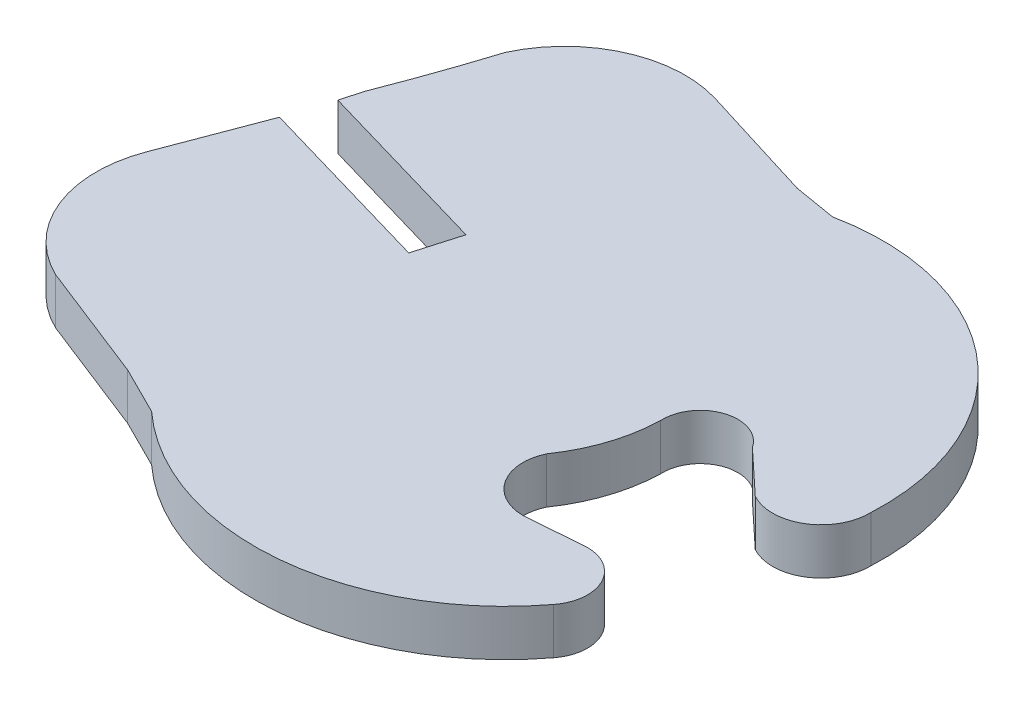
ISO-10303-21;
HEADER;
FILE_DESCRIPTION(('STEP AP214'),'2;1');
FILE_NAME('part.step','',(''),(''),'','','');
FILE_SCHEMA(('AUTOMOTIVE_DESIGN { 1 0 10303 214 1 1 1 1 }'));
ENDSEC;
DATA;
#1=APPLICATION_CONTEXT('core data for automotive mechanical design processes');
#2=APPLICATION_PROTOCOL_DEFINITION('international standard','automotive_design',2000,#1);
#3=PRODUCT_CONTEXT('',#1,'mechanical');
#4=PRODUCT('Part','Part','',(#3));
#5=PRODUCT_RELATED_PRODUCT_CATEGORY('part','',(#4));
#6=PRODUCT_DEFINITION_FORMATION('','',#4);
#7=PRODUCT_DEFINITION_CONTEXT('part definition',#1,'design');
#8=PRODUCT_DEFINITION('design','',#6,#7);
#9=PRODUCT_DEFINITION_SHAPE('','',#8);
#10=(LENGTH_UNIT() NAMED_UNIT(*) SI_UNIT(.MILLI.,.METRE.));
#11=(NAMED_UNIT(*) PLANE_ANGLE_UNIT() SI_UNIT($,.RADIAN.));
#12=(NAMED_UNIT(*) SI_UNIT($,.STERADIAN.) SOLID_ANGLE_UNIT());
#13=UNCERTAINTY_MEASURE_WITH_UNIT(LENGTH_MEASURE(1.E-05),#10,'distance_accuracy_value','');
#14=(GEOMETRIC_REPRESENTATION_CONTEXT(3) GLOBAL_UNCERTAINTY_ASSIGNED_CONTEXT((#13)) GLOBAL_UNIT_ASSIGNED_CONTEXT((#10,
#11,#12)) REPRESENTATION_CONTEXT('',''));
#15=CARTESIAN_POINT('',(0.,0.,0.));
#16=DIRECTION('',(0.,0.,1.));
#17=DIRECTION('',(1.,0.,0.));
#18=AXIS2_PLACEMENT_3D('',#15,#16,#17);
#19=CARTESIAN_POINT('',(-253.536967801551,2.,-735.500523132252));
#20=DIRECTION('',(0.,-1.,0.));
#21=DIRECTION('',(0.,0.,-1.));
#22=AXIS2_PLACEMENT_3D('',#19,#20,#21);
#23=CYLINDRICAL_SURFACE('',#22,71.0818539639846);
#24=CARTESIAN_POINT('',(-253.536967801551,0.,-735.500523132252));
#25=DIRECTION('',(0.,1.,0.));
#26=DIRECTION('',(0.,0.,1.));
#27=AXIS2_PLACEMENT_3D('',#24,#25,#26);
#28=CIRCLE('',#27,71.0818539639846);
#29=CARTESIAN_POINT('',(-187.311900000046,0.,-709.676689999982));
#30=VERTEX_POINT('',#29);
#31=CARTESIAN_POINT('',(-185.723570000009,0.,-714.193879999953));
#32=VERTEX_POINT('',#31);
#33=EDGE_CURVE('E11',#30,#32,#28,.T.);
#34=ORIENTED_EDGE('',*,*,#33,.F.);
#35=DIRECTION('',(0.,-1.,0.));
#36=VECTOR('',#35,1.);
#37=CARTESIAN_POINT('',(-187.311900000046,2.,-709.676689999982));
#38=LINE('',#37,#36);
#39=CARTESIAN_POINT('',(-187.311900000046,2.,-709.676689999982));
#40=VERTEX_POINT('',#39);
#41=EDGE_CURVE('E56',#40,#30,#38,.T.);
#42=ORIENTED_EDGE('',*,*,#41,.F.);
#43=CARTESIAN_POINT('',(-253.536967801551,2.,-735.500523132252));
#44=DIRECTION('',(0.,1.,0.));
#45=DIRECTION('',(0.,0.,1.));
#46=AXIS2_PLACEMENT_3D('',#43,#44,#45);
#47=CIRCLE('',#46,71.0818539639846);
#48=CARTESIAN_POINT('',(-185.723570000009,2.,-714.193879999953));
#49=VERTEX_POINT('',#48);
#50=EDGE_CURVE('E41',#40,#49,#47,.T.);
#51=ORIENTED_EDGE('',*,*,#50,.T.);
#52=DIRECTION('',(0.,-1.,0.));
#53=VECTOR('',#52,1.);
#54=CARTESIAN_POINT('',(-185.723570000009,2.,-714.193879999953));
#55=LINE('',#54,#53);
#56=EDGE_CURVE('E132',#49,#32,#55,.T.);
#57=ORIENTED_EDGE('',*,*,#56,.T.);
#58=EDGE_LOOP('',(#34,#42,#51,#57));
#59=FACE_BOUND('',#58,.T.);
#60=ADVANCED_FACE('F37',(#59),#23,.F.);
#61=CARTESIAN_POINT('',(-246.404862133182,2.,-495.16026197357));
#62=DIRECTION('',(0.964089313143234,0.,0.265578230062267));
#63=DIRECTION('',(0.265578230062267,0.,-0.964089313143234));
#64=AXIS2_PLACEMENT_3D('',#61,#62,#63);
#65=PLANE('',#64);
#66=DIRECTION('',(-0.265578230062267,0.,0.964089313143234));
#67=VECTOR('',#66,1.);
#68=CARTESIAN_POINT('',(-246.404862133182,0.,-495.16026197357));
#69=LINE('',#68,#67);
#70=CARTESIAN_POINT('',(-187.560110000046,0.,-708.775649999982));
#71=VERTEX_POINT('',#70);
#72=EDGE_CURVE('E47',#30,#71,#69,.T.);
#73=ORIENTED_EDGE('',*,*,#72,.T.);
#74=DIRECTION('',(0.,-1.,0.));
#75=VECTOR('',#74,1.);
#76=CARTESIAN_POINT('',(-187.560110000046,2.,-708.775649999982));
#77=LINE('',#76,#75);
#78=CARTESIAN_POINT('',(-187.560110000046,2.,-708.775649999982));
#79=VERTEX_POINT('',#78);
#80=EDGE_CURVE('E195',#79,#71,#77,.T.);
#81=ORIENTED_EDGE('',*,*,#80,.F.);
#82=DIRECTION('',(-0.265578230062267,0.,0.964089313143234));
#83=VECTOR('',#82,1.);
#84=CARTESIAN_POINT('',(-246.404862133182,2.,-495.16026197357));
#85=LINE('',#84,#83);
#86=EDGE_CURVE('E122',#40,#79,#85,.T.);
#87=ORIENTED_EDGE('',*,*,#86,.F.);
#88=ORIENTED_EDGE('',*,*,#41,.T.);
#89=EDGE_LOOP('',(#73,#81,#87,#88));
#90=FACE_BOUND('',#89,.T.);
#91=ADVANCED_FACE('F364',(#90),#65,.F.);
#92=CARTESIAN_POINT('',(-462.908831557613,2.,-788.794902365143));
#93=DIRECTION('',(0.279065246758814,0.,-0.960272142703016));
#94=DIRECTION('',(-0.960272142703016,0.,-0.279065246758814));
#95=AXIS2_PLACEMENT_3D('',#92,#93,#94);
#96=PLANE('',#95);
#97=DIRECTION('',(0.960272142703016,0.,0.279065246758815));
#98=VECTOR('',#97,1.);
#99=CARTESIAN_POINT('',(-462.908831557613,0.,-788.794902365143));
#100=LINE('',#99,#98);
#101=CARTESIAN_POINT('',(-179.737580000009,0.,-706.502339999971));
#102=VERTEX_POINT('',#101);
#103=EDGE_CURVE('E189',#71,#102,#100,.T.);
#104=ORIENTED_EDGE('',*,*,#103,.T.);
#105=DIRECTION('',(0.,-1.,0.));
#106=VECTOR('',#105,1.);
#107=CARTESIAN_POINT('',(-179.737580000009,2.,-706.502339999971));
#108=LINE('',#107,#106);
#109=CARTESIAN_POINT('',(-179.737580000009,2.,-706.502339999971));
#110=VERTEX_POINT('',#109);
#111=EDGE_CURVE('E193',#110,#102,#108,.T.);
#112=ORIENTED_EDGE('',*,*,#111,.F.);
#113=DIRECTION('',(0.960272142703016,0.,0.279065246758815));
#114=VECTOR('',#113,1.);
#115=CARTESIAN_POINT('',(-462.908831557613,2.,-788.794902365143));
#116=LINE('',#115,#114);
#117=EDGE_CURVE('E254',#79,#110,#116,.T.);
#118=ORIENTED_EDGE('',*,*,#117,.F.);
#119=ORIENTED_EDGE('',*,*,#80,.T.);
#120=EDGE_LOOP('',(#104,#112,#118,#119));
#121=FACE_BOUND('',#120,.T.);
#122=ADVANCED_FACE('F191',(#121),#96,.F.);
#123=CARTESIAN_POINT('',(-242.699576697375,2.,-489.851208102719));
#124=DIRECTION('',(0.960271091452544,0.,0.279068864118768));
#125=DIRECTION('',(0.279068864118768,0.,-0.960271091452544));
#126=AXIS2_PLACEMENT_3D('',#123,#124,#125);
#127=PLANE('',#126);
#128=DIRECTION('',(-0.279068864118768,0.,0.960271091452544));
#129=VECTOR('',#128,1.);
#130=CARTESIAN_POINT('',(-242.699576697375,0.,-489.851208102719));
#131=LINE('',#130,#129);
#132=CARTESIAN_POINT('',(-180.29572,0.,-704.58179));
#133=VERTEX_POINT('',#132);
#134=EDGE_CURVE('E198',#102,#133,#131,.T.);
#135=ORIENTED_EDGE('',*,*,#134,.T.);
#136=DIRECTION('',(0.,-1.,0.));
#137=VECTOR('',#136,1.);
#138=CARTESIAN_POINT('',(-180.29572,2.,-704.58179));
#139=LINE('',#138,#137);
#140=CARTESIAN_POINT('',(-180.29572,2.,-704.58179));
#141=VERTEX_POINT('',#140);
#142=EDGE_CURVE('E205',#141,#133,#139,.T.);
#143=ORIENTED_EDGE('',*,*,#142,.F.);
#144=DIRECTION('',(-0.279068864118768,0.,0.960271091452544));
#145=VECTOR('',#144,1.);
#146=CARTESIAN_POINT('',(-242.699576697375,2.,-489.851208102719));
#147=LINE('',#146,#145);
#148=EDGE_CURVE('E204',#110,#141,#147,.T.);
#149=ORIENTED_EDGE('',*,*,#148,.F.);
#150=ORIENTED_EDGE('',*,*,#111,.T.);
#151=EDGE_LOOP('',(#135,#143,#149,#150));
#152=FACE_BOUND('',#151,.T.);
#153=ADVANCED_FACE('F201',(#152),#127,.F.);
#154=CARTESIAN_POINT('',(-463.466398165116,2.,-786.874771070459));
#155=DIRECTION('',(-0.279067077141788,0.,0.960271610772462));
#156=DIRECTION('',(0.960271610772462,0.,0.279067077141788));
#157=AXIS2_PLACEMENT_3D('',#154,#155,#156);
#158=PLANE('',#157);
#159=DIRECTION('',(-0.960271610772462,0.,-0.279067077141788));
#160=VECTOR('',#159,1.);
#161=CARTESIAN_POINT('',(-463.466398165116,0.,-786.874771070459));
#162=LINE('',#161,#160);
#163=CARTESIAN_POINT('',(-188.18261,0.,-706.87382));
#164=VERTEX_POINT('',#163);
#165=EDGE_CURVE('E210',#133,#164,#162,.T.);
#166=ORIENTED_EDGE('',*,*,#165,.T.);
#167=DIRECTION('',(0.,-1.,0.));
#168=VECTOR('',#167,1.);
#169=CARTESIAN_POINT('',(-188.18261,2.,-706.87382));
#170=LINE('',#169,#168);
#171=CARTESIAN_POINT('',(-188.18261,2.,-706.87382));
#172=VERTEX_POINT('',#171);
#173=EDGE_CURVE('E303',#172,#164,#170,.T.);
#174=ORIENTED_EDGE('',*,*,#173,.F.);
#175=DIRECTION('',(-0.960271610772462,0.,-0.279067077141788));
#176=VECTOR('',#175,1.);
#177=CARTESIAN_POINT('',(-463.466398165116,2.,-786.874771070459));
#178=LINE('',#177,#176);
#179=EDGE_CURVE('E251',#141,#172,#178,.T.);
#180=ORIENTED_EDGE('',*,*,#179,.F.);
#181=ORIENTED_EDGE('',*,*,#142,.T.);
#182=EDGE_LOOP('',(#166,#174,#180,#181));
#183=FACE_BOUND('',#182,.T.);
#184=ADVANCED_FACE('F375',(#183),#158,.F.);
#185=CARTESIAN_POINT('',(-275.057840685648,2.,-477.252225552402));
#186=DIRECTION('',(0.935297872812625,0.,0.353861398166258));
#187=DIRECTION('',(0.353861398166258,0.,-0.935297872812625));
#188=AXIS2_PLACEMENT_3D('',#185,#186,#187);
#189=PLANE('',#188);
#190=DIRECTION('',(-0.353861398166258,0.,0.935297872812625));
#191=VECTOR('',#190,1.);
#192=CARTESIAN_POINT('',(-275.057840685648,0.,-477.252225552402));
#193=LINE('',#192,#191);
#194=CARTESIAN_POINT('',(-189.75504,0.,-702.7177));
#195=VERTEX_POINT('',#194);
#196=EDGE_CURVE('E212',#164,#195,#193,.T.);
#197=ORIENTED_EDGE('',*,*,#196,.T.);
#198=DIRECTION('',(0.,-1.,0.));
#199=VECTOR('',#198,1.);
#200=CARTESIAN_POINT('',(-189.75504,2.,-702.7177));
#201=LINE('',#200,#199);
#202=CARTESIAN_POINT('',(-189.75504,2.,-702.7177));
#203=VERTEX_POINT('',#202);
#204=EDGE_CURVE('E300',#203,#195,#201,.T.);
#205=ORIENTED_EDGE('',*,*,#204,.F.);
#206=DIRECTION('',(-0.353861398166258,0.,0.935297872812625));
#207=VECTOR('',#206,1.);
#208=CARTESIAN_POINT('',(-275.057840685648,2.,-477.252225552402));
#209=LINE('',#208,#207);
#210=EDGE_CURVE('E249',#172,#203,#209,.T.);
#211=ORIENTED_EDGE('',*,*,#210,.F.);
#212=ORIENTED_EDGE('',*,*,#173,.T.);
#213=EDGE_LOOP('',(#197,#205,#211,#212));
#214=FACE_BOUND('',#213,.T.);
#215=ADVANCED_FACE('F298',(#214),#189,.F.);
#216=CARTESIAN_POINT('',(-184.856848774086,2.,-700.849436922793));
#217=DIRECTION('',(0.,-1.,0.));
#218=DIRECTION('',(0.,0.,-1.));
#219=AXIS2_PLACEMENT_3D('',#216,#217,#218);
#220=CYLINDRICAL_SURFACE('',#219,5.2423929852);
#221=CARTESIAN_POINT('',(-184.856848774086,0.,-700.849436922793));
#222=DIRECTION('',(0.,1.,0.));
#223=DIRECTION('',(0.,0.,1.));
#224=AXIS2_PLACEMENT_3D('',#221,#222,#223);
#225=CIRCLE('',#224,5.2423929852);
#226=CARTESIAN_POINT('',(-187.128520000016,0.,-696.124799999965));
#227=VERTEX_POINT('',#226);
#228=EDGE_CURVE('E293',#195,#227,#225,.T.);
#229=ORIENTED_EDGE('',*,*,#228,.T.);
#230=DIRECTION('',(0.,-1.,0.));
#231=VECTOR('',#230,1.);
#232=CARTESIAN_POINT('',(-187.128520000016,2.,-696.124799999965));
#233=LINE('',#232,#231);
#234=CARTESIAN_POINT('',(-187.128520000016,2.,-696.124799999965));
#235=VERTEX_POINT('',#234);
#236=EDGE_CURVE('E309',#235,#227,#233,.T.);
#237=ORIENTED_EDGE('',*,*,#236,.F.);
#238=CARTESIAN_POINT('',(-184.856848774086,2.,-700.849436922793));
#239=DIRECTION('',(0.,1.,0.));
#240=DIRECTION('',(0.,0.,1.));
#241=AXIS2_PLACEMENT_3D('',#238,#239,#240);
#242=CIRCLE('',#241,5.2423929852);
#243=EDGE_CURVE('E247',#203,#235,#242,.T.);
#244=ORIENTED_EDGE('',*,*,#243,.F.);
#245=ORIENTED_EDGE('',*,*,#204,.T.);
#246=EDGE_LOOP('',(#229,#237,#244,#245));
#247=FACE_BOUND('',#246,.T.);
#248=ADVANCED_FACE('F306',(#247),#220,.T.);
#249=CARTESIAN_POINT('',(-438.470963875038,2.,-794.788940411859));
#250=DIRECTION('',(0.36540360369791,0.,-0.930849185638888));
#251=DIRECTION('',(-0.930849185638888,0.,-0.36540360369791));
#252=AXIS2_PLACEMENT_3D('',#249,#250,#251);
#253=PLANE('',#252);
#254=DIRECTION('',(0.930849185638888,0.,0.36540360369791));
#255=VECTOR('',#254,1.);
#256=CARTESIAN_POINT('',(-438.470963875038,0.,-794.788940411859));
#257=LINE('',#256,#255);
#258=CARTESIAN_POINT('',(-181.99736,0.,-694.11057));
#259=VERTEX_POINT('',#258);
#260=EDGE_CURVE('E291',#227,#259,#257,.T.);
#261=ORIENTED_EDGE('',*,*,#260,.T.);
#262=DIRECTION('',(0.,-1.,0.));
#263=VECTOR('',#262,1.);
#264=CARTESIAN_POINT('',(-181.99736,2.,-694.11057));
#265=LINE('',#264,#263);
#266=CARTESIAN_POINT('',(-181.99736,2.,-694.11057));
#267=VERTEX_POINT('',#266);
#268=EDGE_CURVE('E319',#267,#259,#265,.T.);
#269=ORIENTED_EDGE('',*,*,#268,.F.);
#270=DIRECTION('',(0.930849185638888,0.,0.36540360369791));
#271=VECTOR('',#270,1.);
#272=CARTESIAN_POINT('',(-438.470963875038,2.,-794.788940411859));
#273=LINE('',#272,#271);
#274=EDGE_CURVE('E245',#235,#267,#273,.T.);
#275=ORIENTED_EDGE('',*,*,#274,.F.);
#276=ORIENTED_EDGE('',*,*,#236,.T.);
#277=EDGE_LOOP('',(#261,#269,#275,#276));
#278=FACE_BOUND('',#277,.T.);
#279=ADVANCED_FACE('F317',(#278),#253,.F.);
#280=CARTESIAN_POINT('',(-408.354469762057,2.,-807.252060048962));
#281=DIRECTION('',(0.447096417645095,0.,-0.894485770333393));
#282=DIRECTION('',(-0.894485770333393,0.,-0.447096417645095));
#283=AXIS2_PLACEMENT_3D('',#280,#281,#282);
#284=PLANE('',#283);
#285=DIRECTION('',(0.894485770333393,0.,0.447096417645095));
#286=VECTOR('',#285,1.);
#287=CARTESIAN_POINT('',(-408.354469762057,0.,-807.252060048962));
#288=LINE('',#287,#286);
#289=CARTESIAN_POINT('',(-179.92096,0.,-693.07271));
#290=VERTEX_POINT('',#289);
#291=EDGE_CURVE('E289',#259,#290,#288,.T.);
#292=ORIENTED_EDGE('',*,*,#291,.T.);
#293=DIRECTION('',(0.,-1.,0.));
#294=VECTOR('',#293,1.);
#295=CARTESIAN_POINT('',(-179.92096,2.,-693.07271));
#296=LINE('',#295,#294);
#297=CARTESIAN_POINT('',(-179.92096,2.,-693.07271));
#298=VERTEX_POINT('',#297);
#299=EDGE_CURVE('E325',#298,#290,#296,.T.);
#300=ORIENTED_EDGE('',*,*,#299,.F.);
#301=DIRECTION('',(0.894485770333393,0.,0.447096417645095));
#302=VECTOR('',#301,1.);
#303=CARTESIAN_POINT('',(-408.354469762057,2.,-807.252060048962));
#304=LINE('',#303,#302);
#305=EDGE_CURVE('E243',#267,#298,#304,.T.);
#306=ORIENTED_EDGE('',*,*,#305,.F.);
#307=ORIENTED_EDGE('',*,*,#268,.T.);
#308=EDGE_LOOP('',(#292,#300,#306,#307));
#309=FACE_BOUND('',#308,.T.);
#310=ADVANCED_FACE('F322',(#309),#284,.F.);
#311=CARTESIAN_POINT('',(-172.617160878917,2.,-701.071479919178));
#312=DIRECTION('',(0.,-1.,0.));
#313=DIRECTION('',(0.,0.,-1.));
#314=AXIS2_PLACEMENT_3D('',#311,#312,#313);
#315=CYLINDRICAL_SURFACE('',#314,10.8317035512);
#316=CARTESIAN_POINT('',(-172.617160878917,0.,-701.071479919178));
#317=DIRECTION('',(0.,1.,0.));
#318=DIRECTION('',(0.,0.,1.));
#319=AXIS2_PLACEMENT_3D('',#316,#317,#318);
#320=CIRCLE('',#319,10.8317035512);
#321=CARTESIAN_POINT('',(-163.977899999968,0.,-694.537799999978));
#322=VERTEX_POINT('',#321);
#323=EDGE_CURVE('E287',#290,#322,#320,.T.);
#324=ORIENTED_EDGE('',*,*,#323,.T.);
#325=DIRECTION('',(0.,-1.,0.));
#326=VECTOR('',#325,1.);
#327=CARTESIAN_POINT('',(-163.977899999968,2.,-694.537799999978));
#328=LINE('',#327,#326);
#329=CARTESIAN_POINT('',(-163.977899999968,2.,-694.537799999978));
#330=VERTEX_POINT('',#329);
#331=EDGE_CURVE('E327',#330,#322,#328,.T.);
#332=ORIENTED_EDGE('',*,*,#331,.F.);
#333=CARTESIAN_POINT('',(-172.617160878917,2.,-701.071479919178));
#334=DIRECTION('',(0.,1.,0.));
#335=DIRECTION('',(0.,0.,1.));
#336=AXIS2_PLACEMENT_3D('',#333,#334,#335);
#337=CIRCLE('',#336,10.8317035512);
#338=EDGE_CURVE('E241',#298,#330,#337,.T.);
#339=ORIENTED_EDGE('',*,*,#338,.F.);
#340=ORIENTED_EDGE('',*,*,#299,.T.);
#341=EDGE_LOOP('',(#324,#332,#339,#340));
#342=FACE_BOUND('',#341,.T.);
#343=ADVANCED_FACE('F387',(#342),#315,.T.);
#344=CARTESIAN_POINT('',(-165.377629532629,2.,-695.6308790457));
#345=DIRECTION('',(0.,-1.,0.));
#346=DIRECTION('',(0.,0.,-1.));
#347=AXIS2_PLACEMENT_3D('',#344,#345,#346);
#348=CYLINDRICAL_SURFACE('',#347,1.77596862719998);
#349=CARTESIAN_POINT('',(-165.377629532629,0.,-695.6308790457));
#350=DIRECTION('',(0.,1.,0.));
#351=DIRECTION('',(0.,0.,1.));
#352=AXIS2_PLACEMENT_3D('',#349,#350,#351);
#353=CIRCLE('',#352,1.77596862719998);
#354=CARTESIAN_POINT('',(-165.382850000039,0.,-697.40684000009));
#355=VERTEX_POINT('',#354);
#356=EDGE_CURVE('E285',#322,#355,#353,.T.);
#357=ORIENTED_EDGE('',*,*,#356,.T.);
#358=DIRECTION('',(0.,-1.,0.));
#359=VECTOR('',#358,1.);
#360=CARTESIAN_POINT('',(-165.382850000039,2.,-697.40684000009));
#361=LINE('',#360,#359);
#362=CARTESIAN_POINT('',(-165.382850000039,2.,-697.40684000009));
#363=VERTEX_POINT('',#362);
#364=EDGE_CURVE('E333',#363,#355,#361,.T.);
#365=ORIENTED_EDGE('',*,*,#364,.F.);
#366=CARTESIAN_POINT('',(-165.377629532629,2.,-695.6308790457));
#367=DIRECTION('',(0.,1.,0.));
#368=DIRECTION('',(0.,0.,1.));
#369=AXIS2_PLACEMENT_3D('',#366,#367,#368);
#370=CIRCLE('',#369,1.77596862719998);
#371=EDGE_CURVE('E239',#330,#363,#370,.T.);
#372=ORIENTED_EDGE('',*,*,#371,.F.);
#373=ORIENTED_EDGE('',*,*,#331,.T.);
#374=EDGE_LOOP('',(#357,#365,#372,#373));
#375=FACE_BOUND('',#374,.T.);
#376=ADVANCED_FACE('F390',(#375),#348,.T.);
#377=CARTESIAN_POINT('',(-533.322445939473,2.,-669.134090830796));
#378=DIRECTION('',(0.0766148821574353,0.,0.997060760351145));
#379=DIRECTION('',(0.997060760351145,0.,-0.0766148821574353));
#380=AXIS2_PLACEMENT_3D('',#377,#378,#379);
#381=PLANE('',#380);
#382=DIRECTION('',(-0.997060760351144,0.,0.0766148821574353));
#383=VECTOR('',#382,1.);
#384=CARTESIAN_POINT('',(-533.322445939473,0.,-669.134090830796));
#385=LINE('',#384,#383);
#386=CARTESIAN_POINT('',(-167.76505,0.,-697.22379));
#387=VERTEX_POINT('',#386);
#388=EDGE_CURVE('E282',#355,#387,#385,.T.);
#389=ORIENTED_EDGE('',*,*,#388,.T.);
#390=DIRECTION('',(0.,-1.,0.));
#391=VECTOR('',#390,1.);
#392=CARTESIAN_POINT('',(-167.76505,2.,-697.22379));
#393=LINE('',#392,#391);
#394=CARTESIAN_POINT('',(-167.76505,2.,-697.22379));
#395=VERTEX_POINT('',#394);
#396=EDGE_CURVE('E336',#395,#387,#393,.T.);
#397=ORIENTED_EDGE('',*,*,#396,.F.);
#398=DIRECTION('',(-0.997060760351144,0.,0.0766148821574353));
#399=VECTOR('',#398,1.);
#400=CARTESIAN_POINT('',(-533.322445939473,2.,-669.134090830796));
#401=LINE('',#400,#399);
#402=EDGE_CURVE('E237',#363,#395,#401,.T.);
#403=ORIENTED_EDGE('',*,*,#402,.F.);
#404=ORIENTED_EDGE('',*,*,#364,.T.);
#405=EDGE_LOOP('',(#389,#397,#403,#404));
#406=FACE_BOUND('',#405,.T.);
#407=ADVANCED_FACE('F394',(#406),#381,.F.);
#408=CARTESIAN_POINT('',(-167.982611307997,2.,-699.194911822273));
#409=DIRECTION('',(0.,-1.,0.));
#410=DIRECTION('',(0.,0.,-1.));
#411=AXIS2_PLACEMENT_3D('',#408,#409,#410);
#412=CYLINDRICAL_SURFACE('',#411,1.98309207072681);
#413=CARTESIAN_POINT('',(-167.982611307997,0.,-699.194911822273));
#414=DIRECTION('',(0.,1.,0.));
#415=DIRECTION('',(0.,0.,1.));
#416=AXIS2_PLACEMENT_3D('',#413,#414,#415);
#417=CIRCLE('',#416,1.98309207072681);
#418=CARTESIAN_POINT('',(-169.780509999981,0.,-700.031699999976));
#419=VERTEX_POINT('',#418);
#420=EDGE_CURVE('E279',#419,#387,#417,.T.);
#421=ORIENTED_EDGE('',*,*,#420,.F.);
#422=DIRECTION('',(0.,-1.,0.));
#423=VECTOR('',#422,1.);
#424=CARTESIAN_POINT('',(-169.780509999981,2.,-700.031699999976));
#425=LINE('',#424,#423);
#426=CARTESIAN_POINT('',(-169.780509999981,2.,-700.031699999976));
#427=VERTEX_POINT('',#426);
#428=EDGE_CURVE('E338',#427,#419,#425,.T.);
#429=ORIENTED_EDGE('',*,*,#428,.F.);
#430=CARTESIAN_POINT('',(-167.982611307997,2.,-699.194911822273));
#431=DIRECTION('',(0.,1.,0.));
#432=DIRECTION('',(0.,0.,1.));
#433=AXIS2_PLACEMENT_3D('',#430,#431,#432);
#434=CIRCLE('',#433,1.98309207072681);
#435=EDGE_CURVE('E234',#427,#395,#434,.T.);
#436=ORIENTED_EDGE('',*,*,#435,.T.);
#437=ORIENTED_EDGE('',*,*,#396,.T.);
#438=EDGE_LOOP('',(#421,#429,#436,#437));
#439=FACE_BOUND('',#438,.T.);
#440=ADVANCED_FACE('F398',(#439),#412,.F.);
#441=CARTESIAN_POINT('',(-175.386632426423,2.,-703.933032604025));
#442=DIRECTION('',(0.,-1.,0.));
#443=DIRECTION('',(0.,0.,-1.));
#444=AXIS2_PLACEMENT_3D('',#441,#442,#443);
#445=CYLINDRICAL_SURFACE('',#444,6.83000766820003);
#446=CARTESIAN_POINT('',(-175.386632426423,0.,-703.933032604025));
#447=DIRECTION('',(0.,1.,0.));
#448=DIRECTION('',(0.,0.,1.));
#449=AXIS2_PLACEMENT_3D('',#446,#447,#448);
#450=CIRCLE('',#449,6.83000766820003);
#451=CARTESIAN_POINT('',(-168.55894000005,0.,-703.755209999941));
#452=VERTEX_POINT('',#451);
#453=EDGE_CURVE('E276',#419,#452,#450,.T.);
#454=ORIENTED_EDGE('',*,*,#453,.T.);
#455=DIRECTION('',(0.,-1.,0.));
#456=VECTOR('',#455,1.);
#457=CARTESIAN_POINT('',(-168.55894000005,2.,-703.755209999941));
#458=LINE('',#457,#456);
#459=CARTESIAN_POINT('',(-168.55894000005,2.,-703.755209999941));
#460=VERTEX_POINT('',#459);
#461=EDGE_CURVE('E340',#460,#452,#458,.T.);
#462=ORIENTED_EDGE('',*,*,#461,.F.);
#463=CARTESIAN_POINT('',(-175.386632426423,2.,-703.933032604025));
#464=DIRECTION('',(0.,1.,0.));
#465=DIRECTION('',(0.,0.,1.));
#466=AXIS2_PLACEMENT_3D('',#463,#464,#465);
#467=CIRCLE('',#466,6.83000766820003);
#468=EDGE_CURVE('E232',#427,#460,#467,.T.);
#469=ORIENTED_EDGE('',*,*,#468,.F.);
#470=ORIENTED_EDGE('',*,*,#428,.T.);
#471=EDGE_LOOP('',(#454,#462,#469,#470));
#472=FACE_BOUND('',#471,.T.);
#473=ADVANCED_FACE('F402',(#472),#445,.T.);
#474=CARTESIAN_POINT('',(-166.930930943495,2.,-703.840199692086));
#475=DIRECTION('',(0.,-1.,0.));
#476=DIRECTION('',(0.,0.,-1.));
#477=AXIS2_PLACEMENT_3D('',#474,#475,#476);
#478=CYLINDRICAL_SURFACE('',#477,1.6302259769732);
#479=CARTESIAN_POINT('',(-166.930930943495,0.,-703.840199692086));
#480=DIRECTION('',(0.,1.,0.));
#481=DIRECTION('',(0.,0.,1.));
#482=AXIS2_PLACEMENT_3D('',#479,#480,#481);
#483=CIRCLE('',#482,1.6302259769732);
#484=CARTESIAN_POINT('',(-165.566220000025,0.,-704.731940000009));
#485=VERTEX_POINT('',#484);
#486=EDGE_CURVE('E273',#485,#452,#483,.T.);
#487=ORIENTED_EDGE('',*,*,#486,.F.);
#488=DIRECTION('',(0.,-1.,0.));
#489=VECTOR('',#488,1.);
#490=CARTESIAN_POINT('',(-165.566220000025,2.,-704.731940000009));
#491=LINE('',#490,#489);
#492=CARTESIAN_POINT('',(-165.566220000025,2.,-704.731940000009));
#493=VERTEX_POINT('',#492);
#494=EDGE_CURVE('E342',#493,#485,#491,.T.);
#495=ORIENTED_EDGE('',*,*,#494,.F.);
#496=CARTESIAN_POINT('',(-166.930930943495,2.,-703.840199692086));
#497=DIRECTION('',(0.,1.,0.));
#498=DIRECTION('',(0.,0.,1.));
#499=AXIS2_PLACEMENT_3D('',#496,#497,#498);
#500=CIRCLE('',#499,1.6302259769732);
#501=EDGE_CURVE('E229',#493,#460,#500,.T.);
#502=ORIENTED_EDGE('',*,*,#501,.T.);
#503=ORIENTED_EDGE('',*,*,#461,.T.);
#504=EDGE_LOOP('',(#487,#495,#502,#503));
#505=FACE_BOUND('',#504,.T.);
#506=ADVANCED_FACE('F406',(#505),#478,.F.);
#507=CARTESIAN_POINT('',(-291.762085973035,2.,-822.661677941913));
#508=DIRECTION('',(0.682772753415186,0.,-0.730630800879518));
#509=DIRECTION('',(-0.730630800879518,0.,-0.682772753415186));
#510=AXIS2_PLACEMENT_3D('',#507,#508,#509);
#511=PLANE('',#510);
#512=DIRECTION('',(0.730630800879518,0.,0.682772753415186));
#513=VECTOR('',#512,1.);
#514=CARTESIAN_POINT('',(-291.762085973035,0.,-822.661677941913));
#515=LINE('',#514,#513);
#516=CARTESIAN_POINT('',(-163.672090000017,0.,-702.961879999971));
#517=VERTEX_POINT('',#516);
#518=EDGE_CURVE('E271',#485,#517,#515,.T.);
#519=ORIENTED_EDGE('',*,*,#518,.T.);
#520=DIRECTION('',(0.,-1.,0.));
#521=VECTOR('',#520,1.);
#522=CARTESIAN_POINT('',(-163.672090000017,2.,-702.961879999971));
#523=LINE('',#522,#521);
#524=CARTESIAN_POINT('',(-163.672090000017,2.,-702.961879999971));
#525=VERTEX_POINT('',#524);
#526=EDGE_CURVE('E344',#525,#517,#523,.T.);
#527=ORIENTED_EDGE('',*,*,#526,.F.);
#528=DIRECTION('',(0.730630800879518,0.,0.682772753415186));
#529=VECTOR('',#528,1.);
#530=CARTESIAN_POINT('',(-291.762085973035,2.,-822.661677941913));
#531=LINE('',#530,#529);
#532=EDGE_CURVE('E227',#493,#525,#531,.T.);
#533=ORIENTED_EDGE('',*,*,#532,.F.);
#534=ORIENTED_EDGE('',*,*,#494,.T.);
#535=EDGE_LOOP('',(#519,#527,#533,#534));
#536=FACE_BOUND('',#535,.T.);
#537=ADVANCED_FACE('F410',(#536),#511,.F.);
#538=CARTESIAN_POINT('',(-162.657320325115,2.,-704.801609802396));
#539=DIRECTION('',(0.,-1.,0.));
#540=DIRECTION('',(0.,0.,-1.));
#541=AXIS2_PLACEMENT_3D('',#538,#539,#540);
#542=CYLINDRICAL_SURFACE('',#541,2.10103860959998);
#543=CARTESIAN_POINT('',(-162.657320325115,0.,-704.801609802396));
#544=DIRECTION('',(0.,1.,0.));
#545=DIRECTION('',(0.,0.,1.));
#546=AXIS2_PLACEMENT_3D('',#543,#544,#545);
#547=CIRCLE('',#546,2.10103860959998);
#548=CARTESIAN_POINT('',(-160.556939999996,0.,-704.854199999984));
#549=VERTEX_POINT('',#548);
#550=EDGE_CURVE('E269',#517,#549,#547,.T.);
#551=ORIENTED_EDGE('',*,*,#550,.T.);
#552=DIRECTION('',(0.,-1.,0.));
#553=VECTOR('',#552,1.);
#554=CARTESIAN_POINT('',(-160.556939999996,2.,-704.854199999984));
#555=LINE('',#554,#553);
#556=CARTESIAN_POINT('',(-160.556939999996,2.,-704.854199999984));
#557=VERTEX_POINT('',#556);
#558=EDGE_CURVE('E347',#557,#549,#555,.T.);
#559=ORIENTED_EDGE('',*,*,#558,.F.);
#560=CARTESIAN_POINT('',(-162.657320325115,2.,-704.801609802396));
#561=DIRECTION('',(0.,1.,0.));
#562=DIRECTION('',(0.,0.,1.));
#563=AXIS2_PLACEMENT_3D('',#560,#561,#562);
#564=CIRCLE('',#563,2.10103860959998);
#565=EDGE_CURVE('E225',#525,#557,#564,.T.);
#566=ORIENTED_EDGE('',*,*,#565,.F.);
#567=ORIENTED_EDGE('',*,*,#526,.T.);
#568=EDGE_LOOP('',(#551,#559,#566,#567));
#569=FACE_BOUND('',#568,.T.);
#570=ADVANCED_FACE('F414',(#569),#542,.T.);
#571=CARTESIAN_POINT('',(-170.483830889551,2.,-705.369370765764));
#572=DIRECTION('',(0.,-1.,0.));
#573=DIRECTION('',(0.,0.,-1.));
#574=AXIS2_PLACEMENT_3D('',#571,#572,#573);
#575=CYLINDRICAL_SURFACE('',#574,9.94024967749996);
#576=CARTESIAN_POINT('',(-170.483830889551,0.,-705.369370765764));
#577=DIRECTION('',(0.,1.,0.));
#578=DIRECTION('',(0.,0.,1.));
#579=AXIS2_PLACEMENT_3D('',#576,#577,#578);
#580=CIRCLE('',#579,9.94024967749996);
#581=CARTESIAN_POINT('',(-172.46853,0.,-715.109469999962));
#582=VERTEX_POINT('',#581);
#583=EDGE_CURVE('E267',#549,#582,#580,.T.);
#584=ORIENTED_EDGE('',*,*,#583,.T.);
#585=DIRECTION('',(0.,-1.,0.));
#586=VECTOR('',#585,1.);
#587=CARTESIAN_POINT('',(-172.46853,2.,-715.109469999962));
#588=LINE('',#587,#586);
#589=CARTESIAN_POINT('',(-172.46853,2.,-715.109469999962));
#590=VERTEX_POINT('',#589);
#591=EDGE_CURVE('E350',#590,#582,#588,.T.);
#592=ORIENTED_EDGE('',*,*,#591,.F.);
#593=CARTESIAN_POINT('',(-170.483830889551,2.,-705.369370765764));
#594=DIRECTION('',(0.,1.,0.));
#595=DIRECTION('',(0.,0.,1.));
#596=AXIS2_PLACEMENT_3D('',#593,#594,#595);
#597=CIRCLE('',#596,9.94024967749996);
#598=EDGE_CURVE('E223',#557,#590,#597,.T.);
#599=ORIENTED_EDGE('',*,*,#598,.F.);
#600=ORIENTED_EDGE('',*,*,#558,.T.);
#601=EDGE_LOOP('',(#584,#592,#599,#600));
#602=FACE_BOUND('',#601,.T.);
#603=ADVANCED_FACE('F418',(#602),#575,.T.);
#604=CARTESIAN_POINT('',(-493.152070072551,2.,-768.533978698621));
#605=DIRECTION('',(-0.164330906477493,0.,0.986405268222086));
#606=DIRECTION('',(0.986405268222086,0.,0.164330906477493));
#607=AXIS2_PLACEMENT_3D('',#604,#605,#606);
#608=PLANE('',#607);
#609=DIRECTION('',(-0.986405268222086,0.,-0.164330906477493));
#610=VECTOR('',#609,1.);
#611=CARTESIAN_POINT('',(-493.152070072551,0.,-768.533978698621));
#612=LINE('',#611,#610);
#613=CARTESIAN_POINT('',(-174.301170000017,0.,-715.414779999971));
#614=VERTEX_POINT('',#613);
#615=EDGE_CURVE('E261',#582,#614,#612,.T.);
#616=ORIENTED_EDGE('',*,*,#615,.T.);
#617=DIRECTION('',(0.,-1.,0.));
#618=VECTOR('',#617,1.);
#619=CARTESIAN_POINT('',(-174.301170000017,2.,-715.414779999971));
#620=LINE('',#619,#618);
#621=CARTESIAN_POINT('',(-174.301170000017,2.,-715.414779999971));
#622=VERTEX_POINT('',#621);
#623=EDGE_CURVE('E353',#622,#614,#620,.T.);
#624=ORIENTED_EDGE('',*,*,#623,.F.);
#625=DIRECTION('',(-0.986405268222086,0.,-0.164330906477493));
#626=VECTOR('',#625,1.);
#627=CARTESIAN_POINT('',(-493.152070072551,2.,-768.533978698621));
#628=LINE('',#627,#626);
#629=EDGE_CURVE('E221',#590,#622,#628,.T.);
#630=ORIENTED_EDGE('',*,*,#629,.F.);
#631=ORIENTED_EDGE('',*,*,#591,.T.);
#632=EDGE_LOOP('',(#616,#624,#630,#631));
#633=FACE_BOUND('',#632,.T.);
#634=ADVANCED_FACE('F422',(#633),#608,.F.);
#635=CARTESIAN_POINT('',(-454.731972124735,2.,-802.148868837582));
#636=DIRECTION('',(-0.295478780075739,0.,0.955349302886098));
#637=DIRECTION('',(0.955349302886098,0.,0.295478780075739));
#638=AXIS2_PLACEMENT_3D('',#635,#636,#637);
#639=PLANE('',#638);
#640=DIRECTION('',(-0.955349302886098,0.,-0.295478780075739));
#641=VECTOR('',#640,1.);
#642=CARTESIAN_POINT('',(-454.731972124735,0.,-802.148868837582));
#643=LINE('',#642,#641);
#644=CARTESIAN_POINT('',(-179.432330000017,0.,-717.001789999972));
#645=VERTEX_POINT('',#644);
#646=EDGE_CURVE('E256',#614,#645,#643,.T.);
#647=ORIENTED_EDGE('',*,*,#646,.T.);
#648=DIRECTION('',(0.,-1.,0.));
#649=VECTOR('',#648,1.);
#650=CARTESIAN_POINT('',(-179.432330000017,2.,-717.001789999972));
#651=LINE('',#650,#649);
#652=CARTESIAN_POINT('',(-179.432330000017,2.,-717.001789999972));
#653=VERTEX_POINT('',#652);
#654=EDGE_CURVE('E355',#653,#645,#651,.T.);
#655=ORIENTED_EDGE('',*,*,#654,.F.);
#656=DIRECTION('',(-0.955349302886098,0.,-0.295478780075739));
#657=VECTOR('',#656,1.);
#658=CARTESIAN_POINT('',(-454.731972124735,2.,-802.148868837582));
#659=LINE('',#658,#657);
#660=EDGE_CURVE('E219',#622,#653,#659,.T.);
#661=ORIENTED_EDGE('',*,*,#660,.F.);
#662=ORIENTED_EDGE('',*,*,#623,.T.);
#663=EDGE_LOOP('',(#647,#655,#661,#662));
#664=FACE_BOUND('',#663,.T.);
#665=ADVANCED_FACE('F426',(#664),#639,.F.);
#666=CARTESIAN_POINT('',(-180.975889089124,2.,-712.008350406457));
#667=DIRECTION('',(0.,-1.,0.));
#668=DIRECTION('',(0.,0.,-1.));
#669=AXIS2_PLACEMENT_3D('',#666,#667,#668);
#670=CYLINDRICAL_SURFACE('',#669,5.22656805519998);
#671=CARTESIAN_POINT('',(-180.975889089124,0.,-712.008350406457));
#672=DIRECTION('',(0.,1.,0.));
#673=DIRECTION('',(0.,0.,1.));
#674=AXIS2_PLACEMENT_3D('',#671,#672,#673);
#675=CIRCLE('',#674,5.22656805519998);
#676=EDGE_CURVE('E255',#645,#32,#675,.T.);
#677=ORIENTED_EDGE('',*,*,#676,.T.);
#678=ORIENTED_EDGE('',*,*,#56,.F.);
#679=CARTESIAN_POINT('',(-180.975889089124,2.,-712.008350406457));
#680=DIRECTION('',(0.,1.,0.));
#681=DIRECTION('',(0.,0.,1.));
#682=AXIS2_PLACEMENT_3D('',#679,#680,#681);
#683=CIRCLE('',#682,5.22656805519998);
#684=EDGE_CURVE('E217',#653,#49,#683,.T.);
#685=ORIENTED_EDGE('',*,*,#684,.F.);
#686=ORIENTED_EDGE('',*,*,#654,.T.);
#687=EDGE_LOOP('',(#677,#678,#685,#686));
#688=FACE_BOUND('',#687,.T.);
#689=ADVANCED_FACE('F358',(#688),#670,.T.);
#690=CARTESIAN_POINT('',(-525.869702128861,2.,-572.1446));
#691=DIRECTION('',(0.,1.,0.));
#692=DIRECTION('',(0.,0.,1.));
#693=AXIS2_PLACEMENT_3D('',#690,#691,#692);
#694=PLANE('',#693);
#695=ORIENTED_EDGE('',*,*,#50,.F.);
#696=ORIENTED_EDGE('',*,*,#86,.T.);
#697=ORIENTED_EDGE('',*,*,#117,.T.);
#698=ORIENTED_EDGE('',*,*,#148,.T.);
#699=ORIENTED_EDGE('',*,*,#179,.T.);
#700=ORIENTED_EDGE('',*,*,#210,.T.);
#701=ORIENTED_EDGE('',*,*,#243,.T.);
#702=ORIENTED_EDGE('',*,*,#274,.T.);
#703=ORIENTED_EDGE('',*,*,#305,.T.);
#704=ORIENTED_EDGE('',*,*,#338,.T.);
#705=ORIENTED_EDGE('',*,*,#371,.T.);
#706=ORIENTED_EDGE('',*,*,#402,.T.);
#707=ORIENTED_EDGE('',*,*,#435,.F.);
#708=ORIENTED_EDGE('',*,*,#468,.T.);
#709=ORIENTED_EDGE('',*,*,#501,.F.);
#710=ORIENTED_EDGE('',*,*,#532,.T.);
#711=ORIENTED_EDGE('',*,*,#565,.T.);
#712=ORIENTED_EDGE('',*,*,#598,.T.);
#713=ORIENTED_EDGE('',*,*,#629,.T.);
#714=ORIENTED_EDGE('',*,*,#660,.T.);
#715=ORIENTED_EDGE('',*,*,#684,.T.);
#716=EDGE_LOOP('',(#695,#696,#697,#698,#699,#700,#701,#702,#703,#704,#705,#706,#707,#708,#709,
#710,#711,#712,#713,#714,#715));
#717=FACE_BOUND('',#716,.T.);
#718=ADVANCED_FACE('F39',(#717),#694,.T.);
#719=CARTESIAN_POINT('',(-525.869702128861,0.,-572.1446));
#720=DIRECTION('',(0.,1.,0.));
#721=DIRECTION('',(0.,0.,1.));
#722=AXIS2_PLACEMENT_3D('',#719,#720,#721);
#723=PLANE('',#722);
#724=ORIENTED_EDGE('',*,*,#33,.T.);
#725=ORIENTED_EDGE('',*,*,#676,.F.);
#726=ORIENTED_EDGE('',*,*,#646,.F.);
#727=ORIENTED_EDGE('',*,*,#615,.F.);
#728=ORIENTED_EDGE('',*,*,#583,.F.);
#729=ORIENTED_EDGE('',*,*,#550,.F.);
#730=ORIENTED_EDGE('',*,*,#518,.F.);
#731=ORIENTED_EDGE('',*,*,#486,.T.);
#732=ORIENTED_EDGE('',*,*,#453,.F.);
#733=ORIENTED_EDGE('',*,*,#420,.T.);
#734=ORIENTED_EDGE('',*,*,#388,.F.);
#735=ORIENTED_EDGE('',*,*,#356,.F.);
#736=ORIENTED_EDGE('',*,*,#323,.F.);
#737=ORIENTED_EDGE('',*,*,#291,.F.);
#738=ORIENTED_EDGE('',*,*,#260,.F.);
#739=ORIENTED_EDGE('',*,*,#228,.F.);
#740=ORIENTED_EDGE('',*,*,#196,.F.);
#741=ORIENTED_EDGE('',*,*,#165,.F.);
#742=ORIENTED_EDGE('',*,*,#134,.F.);
#743=ORIENTED_EDGE('',*,*,#103,.F.);
#744=ORIENTED_EDGE('',*,*,#72,.F.);
#745=EDGE_LOOP('',(#724,#725,#726,#727,#728,#729,#730,#731,#732,#733,#734,#735,#736,#737,#738,
#739,#740,#741,#742,#743,#744));
#746=FACE_BOUND('',#745,.T.);
#747=ADVANCED_FACE('F208',(#746),#723,.F.);
#748=CLOSED_SHELL('',(#60,#91,#122,#153,#184,#215,#248,#279,#310,#343,#376,#407,#440,#473,#506,
#537,#570,#603,#634,#665,#689,#718,#747));
#749=MANIFOLD_SOLID_BREP('B2',#748);
#750=ADVANCED_BREP_SHAPE_REPRESENTATION('',(#18,#749),#14);
#751=SHAPE_DEFINITION_REPRESENTATION(#9,#750);
ENDSEC;
END-ISO-10303-21;
